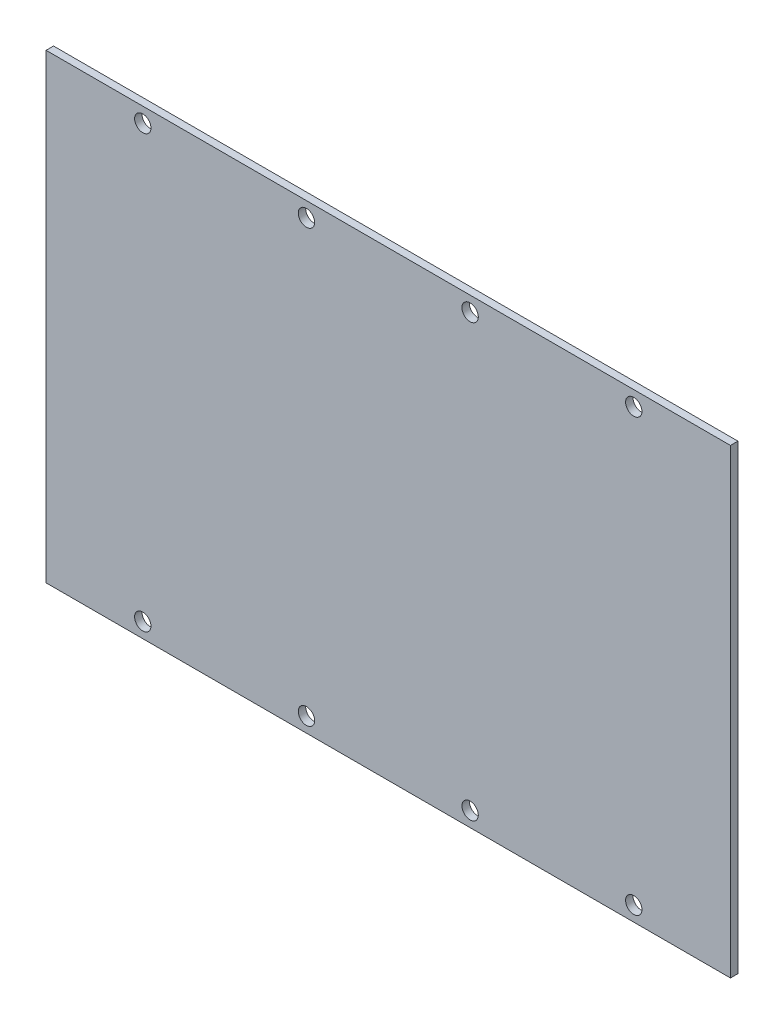
ISO-10303-21;
HEADER;
FILE_DESCRIPTION(('STEP AP214'),'2;1');
FILE_NAME('part.step','',(''),(''),'','','');
FILE_SCHEMA(('AUTOMOTIVE_DESIGN { 1 0 10303 214 1 1 1 1 }'));
ENDSEC;
DATA;
#1=APPLICATION_CONTEXT('core data for automotive mechanical design processes');
#2=APPLICATION_PROTOCOL_DEFINITION('international standard','automotive_design',2000,#1);
#3=PRODUCT_CONTEXT('',#1,'mechanical');
#4=PRODUCT('Part','Part','',(#3));
#5=PRODUCT_RELATED_PRODUCT_CATEGORY('part','',(#4));
#6=PRODUCT_DEFINITION_FORMATION('','',#4);
#7=PRODUCT_DEFINITION_CONTEXT('part definition',#1,'design');
#8=PRODUCT_DEFINITION('design','',#6,#7);
#9=PRODUCT_DEFINITION_SHAPE('','',#8);
#10=(LENGTH_UNIT() NAMED_UNIT(*) SI_UNIT(.MILLI.,.METRE.));
#11=(NAMED_UNIT(*) PLANE_ANGLE_UNIT() SI_UNIT($,.RADIAN.));
#12=(NAMED_UNIT(*) SI_UNIT($,.STERADIAN.) SOLID_ANGLE_UNIT());
#13=UNCERTAINTY_MEASURE_WITH_UNIT(LENGTH_MEASURE(1.E-05),#10,'distance_accuracy_value','');
#14=(GEOMETRIC_REPRESENTATION_CONTEXT(3) GLOBAL_UNCERTAINTY_ASSIGNED_CONTEXT((#13)) GLOBAL_UNIT_ASSIGNED_CONTEXT((#10,
#11,#12)) REPRESENTATION_CONTEXT('',''));
#15=CARTESIAN_POINT('',(0.,0.,0.));
#16=DIRECTION('',(0.,0.,1.));
#17=DIRECTION('',(1.,0.,0.));
#18=AXIS2_PLACEMENT_3D('',#15,#16,#17);
#19=CARTESIAN_POINT('',(0.,0.,-1.));
#20=DIRECTION('',(-1.,0.,0.));
#21=DIRECTION('',(0.,-1.,0.));
#22=AXIS2_PLACEMENT_3D('',#19,#20,#21);
#23=PLANE('',#22);
#24=DIRECTION('',(0.,-1.,0.));
#25=VECTOR('',#24,1.);
#26=CARTESIAN_POINT('',(0.,0.,0.));
#27=LINE('',#26,#25);
#28=CARTESIAN_POINT('',(0.,0.,0.));
#29=VERTEX_POINT('',#28);
#30=CARTESIAN_POINT('',(0.,-62.,0.));
#31=VERTEX_POINT('',#30);
#32=EDGE_CURVE('E99',#29,#31,#27,.T.);
#33=ORIENTED_EDGE('',*,*,#32,.F.);
#34=DIRECTION('',(0.,0.,1.));
#35=VECTOR('',#34,1.);
#36=CARTESIAN_POINT('',(0.,0.,-1.));
#37=LINE('',#36,#35);
#38=CARTESIAN_POINT('',(0.,0.,-1.));
#39=VERTEX_POINT('',#38);
#40=EDGE_CURVE('E11',#39,#29,#37,.T.);
#41=ORIENTED_EDGE('',*,*,#40,.F.);
#42=DIRECTION('',(0.,-1.,0.));
#43=VECTOR('',#42,1.);
#44=CARTESIAN_POINT('',(0.,0.,-1.));
#45=LINE('',#44,#43);
#46=CARTESIAN_POINT('',(0.,-62.,-1.));
#47=VERTEX_POINT('',#46);
#48=EDGE_CURVE('E92',#39,#47,#45,.T.);
#49=ORIENTED_EDGE('',*,*,#48,.T.);
#50=DIRECTION('',(0.,0.,1.));
#51=VECTOR('',#50,1.);
#52=CARTESIAN_POINT('',(0.,-62.,-1.));
#53=LINE('',#52,#51);
#54=EDGE_CURVE('E37',#47,#31,#53,.T.);
#55=ORIENTED_EDGE('',*,*,#54,.T.);
#56=EDGE_LOOP('',(#33,#41,#49,#55));
#57=FACE_BOUND('',#56,.T.);
#58=ADVANCED_FACE('F34',(#57),#23,.T.);
#59=CARTESIAN_POINT('',(0.,0.,-1.));
#60=DIRECTION('',(0.,1.,0.));
#61=DIRECTION('',(0.,0.,1.));
#62=AXIS2_PLACEMENT_3D('',#59,#60,#61);
#63=PLANE('',#62);
#64=DIRECTION('',(-1.,0.,0.));
#65=VECTOR('',#64,1.);
#66=CARTESIAN_POINT('',(0.,0.,0.));
#67=LINE('',#66,#65);
#68=CARTESIAN_POINT('',(92.,0.,0.));
#69=VERTEX_POINT('',#68);
#70=EDGE_CURVE('E94',#69,#29,#67,.T.);
#71=ORIENTED_EDGE('',*,*,#70,.F.);
#72=DIRECTION('',(0.,0.,1.));
#73=VECTOR('',#72,1.);
#74=CARTESIAN_POINT('',(92.,0.,-1.));
#75=LINE('',#74,#73);
#76=CARTESIAN_POINT('',(92.,0.,-1.));
#77=VERTEX_POINT('',#76);
#78=EDGE_CURVE('E43',#77,#69,#75,.T.);
#79=ORIENTED_EDGE('',*,*,#78,.F.);
#80=DIRECTION('',(-1.,0.,0.));
#81=VECTOR('',#80,1.);
#82=CARTESIAN_POINT('',(0.,0.,-1.));
#83=LINE('',#82,#81);
#84=EDGE_CURVE('E89',#77,#39,#83,.T.);
#85=ORIENTED_EDGE('',*,*,#84,.T.);
#86=ORIENTED_EDGE('',*,*,#40,.T.);
#87=EDGE_LOOP('',(#71,#79,#85,#86));
#88=FACE_BOUND('',#87,.T.);
#89=ADVANCED_FACE('F110',(#88),#63,.T.);
#90=CARTESIAN_POINT('',(92.,0.,-1.));
#91=DIRECTION('',(1.,0.,0.));
#92=DIRECTION('',(0.,1.,0.));
#93=AXIS2_PLACEMENT_3D('',#90,#91,#92);
#94=PLANE('',#93);
#95=DIRECTION('',(0.,1.,0.));
#96=VECTOR('',#95,1.);
#97=CARTESIAN_POINT('',(92.,0.,0.));
#98=LINE('',#97,#96);
#99=CARTESIAN_POINT('',(92.,-62.,0.));
#100=VERTEX_POINT('',#99);
#101=EDGE_CURVE('E84',#100,#69,#98,.T.);
#102=ORIENTED_EDGE('',*,*,#101,.F.);
#103=DIRECTION('',(0.,0.,1.));
#104=VECTOR('',#103,1.);
#105=CARTESIAN_POINT('',(92.,-62.,-1.));
#106=LINE('',#105,#104);
#107=CARTESIAN_POINT('',(92.,-62.,-1.));
#108=VERTEX_POINT('',#107);
#109=EDGE_CURVE('E79',#108,#100,#106,.T.);
#110=ORIENTED_EDGE('',*,*,#109,.F.);
#111=DIRECTION('',(0.,1.,0.));
#112=VECTOR('',#111,1.);
#113=CARTESIAN_POINT('',(92.,0.,-1.));
#114=LINE('',#113,#112);
#115=EDGE_CURVE('E82',#108,#77,#114,.T.);
#116=ORIENTED_EDGE('',*,*,#115,.T.);
#117=ORIENTED_EDGE('',*,*,#78,.T.);
#118=EDGE_LOOP('',(#102,#110,#116,#117));
#119=FACE_BOUND('',#118,.T.);
#120=ADVANCED_FACE('F81',(#119),#94,.T.);
#121=CARTESIAN_POINT('',(0.,-62.,-1.));
#122=DIRECTION('',(0.,-1.,0.));
#123=DIRECTION('',(0.,0.,-1.));
#124=AXIS2_PLACEMENT_3D('',#121,#122,#123);
#125=PLANE('',#124);
#126=DIRECTION('',(1.,0.,0.));
#127=VECTOR('',#126,1.);
#128=CARTESIAN_POINT('',(0.,-62.,0.));
#129=LINE('',#128,#127);
#130=EDGE_CURVE('E102',#31,#100,#129,.T.);
#131=ORIENTED_EDGE('',*,*,#130,.F.);
#132=ORIENTED_EDGE('',*,*,#54,.F.);
#133=DIRECTION('',(1.,0.,0.));
#134=VECTOR('',#133,1.);
#135=CARTESIAN_POINT('',(0.,-62.,-1.));
#136=LINE('',#135,#134);
#137=EDGE_CURVE('E88',#47,#108,#136,.T.);
#138=ORIENTED_EDGE('',*,*,#137,.T.);
#139=ORIENTED_EDGE('',*,*,#109,.T.);
#140=EDGE_LOOP('',(#131,#132,#138,#139));
#141=FACE_BOUND('',#140,.T.);
#142=ADVANCED_FACE('F91',(#141),#125,.T.);
#143=CARTESIAN_POINT('',(0.,0.,-1.));
#144=DIRECTION('',(0.,0.,1.));
#145=DIRECTION('',(1.,0.,0.));
#146=AXIS2_PLACEMENT_3D('',#143,#144,#145);
#147=PLANE('',#146);
#148=CARTESIAN_POINT('',(79.,-2.,-1.));
#149=DIRECTION('',(0.,0.,-1.));
#150=DIRECTION('',(-1.,0.,0.));
#151=AXIS2_PLACEMENT_3D('',#148,#149,#150);
#152=CIRCLE('',#151,1.09999999999999);
#153=CARTESIAN_POINT('',(77.9,-2.,-1.));
#154=VERTEX_POINT('',#153);
#155=EDGE_CURVE('E170',#154,#154,#152,.T.);
#156=ORIENTED_EDGE('',*,*,#155,.F.);
#157=EDGE_LOOP('',(#156));
#158=FACE_BOUND('',#157,.T.);
#159=CARTESIAN_POINT('',(57.,-2.,-1.));
#160=DIRECTION('',(0.,0.,-1.));
#161=DIRECTION('',(-1.,0.,0.));
#162=AXIS2_PLACEMENT_3D('',#159,#160,#161);
#163=CIRCLE('',#162,1.09999999999999);
#164=CARTESIAN_POINT('',(55.9,-2.,-1.));
#165=VERTEX_POINT('',#164);
#166=EDGE_CURVE('E172',#165,#165,#163,.T.);
#167=ORIENTED_EDGE('',*,*,#166,.F.);
#168=EDGE_LOOP('',(#167));
#169=FACE_BOUND('',#168,.T.);
#170=CARTESIAN_POINT('',(35.,-2.,-1.));
#171=DIRECTION('',(0.,0.,-1.));
#172=DIRECTION('',(-1.,0.,0.));
#173=AXIS2_PLACEMENT_3D('',#170,#171,#172);
#174=CIRCLE('',#173,1.09999999999999);
#175=CARTESIAN_POINT('',(33.9,-2.,-1.));
#176=VERTEX_POINT('',#175);
#177=EDGE_CURVE('E180',#176,#176,#174,.T.);
#178=ORIENTED_EDGE('',*,*,#177,.F.);
#179=EDGE_LOOP('',(#178));
#180=FACE_BOUND('',#179,.T.);
#181=CARTESIAN_POINT('',(13.,-2.,-1.));
#182=DIRECTION('',(0.,0.,-1.));
#183=DIRECTION('',(-1.,0.,0.));
#184=AXIS2_PLACEMENT_3D('',#181,#182,#183);
#185=CIRCLE('',#184,1.09999999999999);
#186=CARTESIAN_POINT('',(11.9,-2.,-1.));
#187=VERTEX_POINT('',#186);
#188=EDGE_CURVE('E186',#187,#187,#185,.T.);
#189=ORIENTED_EDGE('',*,*,#188,.F.);
#190=EDGE_LOOP('',(#189));
#191=FACE_BOUND('',#190,.T.);
#192=CARTESIAN_POINT('',(13.,-60.,-1.));
#193=DIRECTION('',(0.,0.,-1.));
#194=DIRECTION('',(-1.,0.,0.));
#195=AXIS2_PLACEMENT_3D('',#192,#193,#194);
#196=CIRCLE('',#195,1.09999999999999);
#197=CARTESIAN_POINT('',(11.9,-60.,-1.));
#198=VERTEX_POINT('',#197);
#199=EDGE_CURVE('E192',#198,#198,#196,.T.);
#200=ORIENTED_EDGE('',*,*,#199,.F.);
#201=EDGE_LOOP('',(#200));
#202=FACE_BOUND('',#201,.T.);
#203=CARTESIAN_POINT('',(35.,-60.,-1.));
#204=DIRECTION('',(0.,0.,-1.));
#205=DIRECTION('',(-1.,0.,0.));
#206=AXIS2_PLACEMENT_3D('',#203,#204,#205);
#207=CIRCLE('',#206,1.09999999999999);
#208=CARTESIAN_POINT('',(33.9,-60.,-1.));
#209=VERTEX_POINT('',#208);
#210=EDGE_CURVE('E198',#209,#209,#207,.T.);
#211=ORIENTED_EDGE('',*,*,#210,.F.);
#212=EDGE_LOOP('',(#211));
#213=FACE_BOUND('',#212,.T.);
#214=CARTESIAN_POINT('',(57.,-60.,-1.));
#215=DIRECTION('',(0.,0.,-1.));
#216=DIRECTION('',(-1.,0.,0.));
#217=AXIS2_PLACEMENT_3D('',#214,#215,#216);
#218=CIRCLE('',#217,1.09999999999999);
#219=CARTESIAN_POINT('',(55.9,-60.,-1.));
#220=VERTEX_POINT('',#219);
#221=EDGE_CURVE('E204',#220,#220,#218,.T.);
#222=ORIENTED_EDGE('',*,*,#221,.F.);
#223=EDGE_LOOP('',(#222));
#224=FACE_BOUND('',#223,.T.);
#225=CARTESIAN_POINT('',(79.,-60.,-1.));
#226=DIRECTION('',(0.,0.,-1.));
#227=DIRECTION('',(-1.,0.,0.));
#228=AXIS2_PLACEMENT_3D('',#225,#226,#227);
#229=CIRCLE('',#228,1.09999999999999);
#230=CARTESIAN_POINT('',(77.9,-60.,-1.));
#231=VERTEX_POINT('',#230);
#232=EDGE_CURVE('E210',#231,#231,#229,.T.);
#233=ORIENTED_EDGE('',*,*,#232,.F.);
#234=EDGE_LOOP('',(#233));
#235=FACE_BOUND('',#234,.T.);
#236=ORIENTED_EDGE('',*,*,#48,.F.);
#237=ORIENTED_EDGE('',*,*,#84,.F.);
#238=ORIENTED_EDGE('',*,*,#115,.F.);
#239=ORIENTED_EDGE('',*,*,#137,.F.);
#240=EDGE_LOOP('',(#236,#237,#238,#239));
#241=FACE_BOUND('',#240,.T.);
#242=ADVANCED_FACE('F87',(#158,#169,#180,#191,#202,#213,#224,#235,#241),#147,.F.);
#243=CARTESIAN_POINT('',(0.,0.,0.));
#244=DIRECTION('',(0.,0.,1.));
#245=DIRECTION('',(1.,0.,0.));
#246=AXIS2_PLACEMENT_3D('',#243,#244,#245);
#247=PLANE('',#246);
#248=CARTESIAN_POINT('',(79.,-2.,0.));
#249=DIRECTION('',(0.,0.,-1.));
#250=DIRECTION('',(-1.,0.,0.));
#251=AXIS2_PLACEMENT_3D('',#248,#249,#250);
#252=CIRCLE('',#251,1.09999999999999);
#253=CARTESIAN_POINT('',(77.9,-2.,0.));
#254=VERTEX_POINT('',#253);
#255=EDGE_CURVE('E168',#254,#254,#252,.T.);
#256=ORIENTED_EDGE('',*,*,#255,.T.);
#257=EDGE_LOOP('',(#256));
#258=FACE_BOUND('',#257,.T.);
#259=CARTESIAN_POINT('',(57.,-2.,0.));
#260=DIRECTION('',(0.,0.,-1.));
#261=DIRECTION('',(-1.,0.,0.));
#262=AXIS2_PLACEMENT_3D('',#259,#260,#261);
#263=CIRCLE('',#262,1.09999999999999);
#264=CARTESIAN_POINT('',(55.9,-2.,0.));
#265=VERTEX_POINT('',#264);
#266=EDGE_CURVE('E177',#265,#265,#263,.T.);
#267=ORIENTED_EDGE('',*,*,#266,.T.);
#268=EDGE_LOOP('',(#267));
#269=FACE_BOUND('',#268,.T.);
#270=CARTESIAN_POINT('',(35.,-2.,0.));
#271=DIRECTION('',(0.,0.,-1.));
#272=DIRECTION('',(-1.,0.,0.));
#273=AXIS2_PLACEMENT_3D('',#270,#271,#272);
#274=CIRCLE('',#273,1.09999999999999);
#275=CARTESIAN_POINT('',(33.9,-2.,0.));
#276=VERTEX_POINT('',#275);
#277=EDGE_CURVE('E183',#276,#276,#274,.T.);
#278=ORIENTED_EDGE('',*,*,#277,.T.);
#279=EDGE_LOOP('',(#278));
#280=FACE_BOUND('',#279,.T.);
#281=CARTESIAN_POINT('',(13.,-2.,0.));
#282=DIRECTION('',(0.,0.,-1.));
#283=DIRECTION('',(-1.,0.,0.));
#284=AXIS2_PLACEMENT_3D('',#281,#282,#283);
#285=CIRCLE('',#284,1.09999999999999);
#286=CARTESIAN_POINT('',(11.9,-2.,0.));
#287=VERTEX_POINT('',#286);
#288=EDGE_CURVE('E189',#287,#287,#285,.T.);
#289=ORIENTED_EDGE('',*,*,#288,.T.);
#290=EDGE_LOOP('',(#289));
#291=FACE_BOUND('',#290,.T.);
#292=CARTESIAN_POINT('',(13.,-60.,0.));
#293=DIRECTION('',(0.,0.,-1.));
#294=DIRECTION('',(-1.,0.,0.));
#295=AXIS2_PLACEMENT_3D('',#292,#293,#294);
#296=CIRCLE('',#295,1.09999999999999);
#297=CARTESIAN_POINT('',(11.9,-60.,0.));
#298=VERTEX_POINT('',#297);
#299=EDGE_CURVE('E195',#298,#298,#296,.T.);
#300=ORIENTED_EDGE('',*,*,#299,.T.);
#301=EDGE_LOOP('',(#300));
#302=FACE_BOUND('',#301,.T.);
#303=CARTESIAN_POINT('',(35.,-60.,0.));
#304=DIRECTION('',(0.,0.,-1.));
#305=DIRECTION('',(-1.,0.,0.));
#306=AXIS2_PLACEMENT_3D('',#303,#304,#305);
#307=CIRCLE('',#306,1.09999999999999);
#308=CARTESIAN_POINT('',(33.9,-60.,0.));
#309=VERTEX_POINT('',#308);
#310=EDGE_CURVE('E201',#309,#309,#307,.T.);
#311=ORIENTED_EDGE('',*,*,#310,.T.);
#312=EDGE_LOOP('',(#311));
#313=FACE_BOUND('',#312,.T.);
#314=CARTESIAN_POINT('',(57.,-60.,0.));
#315=DIRECTION('',(0.,0.,-1.));
#316=DIRECTION('',(-1.,0.,0.));
#317=AXIS2_PLACEMENT_3D('',#314,#315,#316);
#318=CIRCLE('',#317,1.09999999999999);
#319=CARTESIAN_POINT('',(55.9,-60.,0.));
#320=VERTEX_POINT('',#319);
#321=EDGE_CURVE('E207',#320,#320,#318,.T.);
#322=ORIENTED_EDGE('',*,*,#321,.T.);
#323=EDGE_LOOP('',(#322));
#324=FACE_BOUND('',#323,.T.);
#325=CARTESIAN_POINT('',(79.,-60.,0.));
#326=DIRECTION('',(0.,0.,-1.));
#327=DIRECTION('',(-1.,0.,0.));
#328=AXIS2_PLACEMENT_3D('',#325,#326,#327);
#329=CIRCLE('',#328,1.09999999999999);
#330=CARTESIAN_POINT('',(77.9,-60.,0.));
#331=VERTEX_POINT('',#330);
#332=EDGE_CURVE('E103',#331,#331,#329,.T.);
#333=ORIENTED_EDGE('',*,*,#332,.T.);
#334=EDGE_LOOP('',(#333));
#335=FACE_BOUND('',#334,.T.);
#336=ORIENTED_EDGE('',*,*,#32,.T.);
#337=ORIENTED_EDGE('',*,*,#130,.T.);
#338=ORIENTED_EDGE('',*,*,#101,.T.);
#339=ORIENTED_EDGE('',*,*,#70,.T.);
#340=EDGE_LOOP('',(#336,#337,#338,#339));
#341=FACE_BOUND('',#340,.T.);
#342=ADVANCED_FACE('F109',(#258,#269,#280,#291,#302,#313,#324,#335,#341),#247,.T.);
#343=CARTESIAN_POINT('',(79.,-60.,-1.));
#344=DIRECTION('',(0.,0.,-1.));
#345=DIRECTION('',(-1.,0.,0.));
#346=AXIS2_PLACEMENT_3D('',#343,#344,#345);
#347=CYLINDRICAL_SURFACE('',#346,1.09999999999999);
#348=ORIENTED_EDGE('',*,*,#332,.F.);
#349=EDGE_LOOP('',(#348));
#350=FACE_BOUND('',#349,.T.);
#351=ORIENTED_EDGE('',*,*,#232,.T.);
#352=EDGE_LOOP('',(#351));
#353=FACE_BOUND('',#352,.T.);
#354=ADVANCED_FACE('F128',(#350,#353),#347,.F.);
#355=CARTESIAN_POINT('',(57.,-60.,-1.));
#356=DIRECTION('',(0.,0.,-1.));
#357=DIRECTION('',(-1.,0.,0.));
#358=AXIS2_PLACEMENT_3D('',#355,#356,#357);
#359=CYLINDRICAL_SURFACE('',#358,1.09999999999999);
#360=ORIENTED_EDGE('',*,*,#321,.F.);
#361=EDGE_LOOP('',(#360));
#362=FACE_BOUND('',#361,.T.);
#363=ORIENTED_EDGE('',*,*,#221,.T.);
#364=EDGE_LOOP('',(#363));
#365=FACE_BOUND('',#364,.T.);
#366=ADVANCED_FACE('F135',(#362,#365),#359,.F.);
#367=CARTESIAN_POINT('',(35.,-60.,-1.));
#368=DIRECTION('',(0.,0.,-1.));
#369=DIRECTION('',(-1.,0.,0.));
#370=AXIS2_PLACEMENT_3D('',#367,#368,#369);
#371=CYLINDRICAL_SURFACE('',#370,1.09999999999999);
#372=ORIENTED_EDGE('',*,*,#310,.F.);
#373=EDGE_LOOP('',(#372));
#374=FACE_BOUND('',#373,.T.);
#375=ORIENTED_EDGE('',*,*,#210,.T.);
#376=EDGE_LOOP('',(#375));
#377=FACE_BOUND('',#376,.T.);
#378=ADVANCED_FACE('F139',(#374,#377),#371,.F.);
#379=CARTESIAN_POINT('',(13.,-60.,-1.));
#380=DIRECTION('',(0.,0.,-1.));
#381=DIRECTION('',(-1.,0.,0.));
#382=AXIS2_PLACEMENT_3D('',#379,#380,#381);
#383=CYLINDRICAL_SURFACE('',#382,1.09999999999999);
#384=ORIENTED_EDGE('',*,*,#299,.F.);
#385=EDGE_LOOP('',(#384));
#386=FACE_BOUND('',#385,.T.);
#387=ORIENTED_EDGE('',*,*,#199,.T.);
#388=EDGE_LOOP('',(#387));
#389=FACE_BOUND('',#388,.T.);
#390=ADVANCED_FACE('F143',(#386,#389),#383,.F.);
#391=CARTESIAN_POINT('',(13.,-2.,-1.));
#392=DIRECTION('',(0.,0.,-1.));
#393=DIRECTION('',(-1.,0.,0.));
#394=AXIS2_PLACEMENT_3D('',#391,#392,#393);
#395=CYLINDRICAL_SURFACE('',#394,1.09999999999999);
#396=ORIENTED_EDGE('',*,*,#288,.F.);
#397=EDGE_LOOP('',(#396));
#398=FACE_BOUND('',#397,.T.);
#399=ORIENTED_EDGE('',*,*,#188,.T.);
#400=EDGE_LOOP('',(#399));
#401=FACE_BOUND('',#400,.T.);
#402=ADVANCED_FACE('F147',(#398,#401),#395,.F.);
#403=CARTESIAN_POINT('',(35.,-2.,-1.));
#404=DIRECTION('',(0.,0.,-1.));
#405=DIRECTION('',(-1.,0.,0.));
#406=AXIS2_PLACEMENT_3D('',#403,#404,#405);
#407=CYLINDRICAL_SURFACE('',#406,1.09999999999999);
#408=ORIENTED_EDGE('',*,*,#277,.F.);
#409=EDGE_LOOP('',(#408));
#410=FACE_BOUND('',#409,.T.);
#411=ORIENTED_EDGE('',*,*,#177,.T.);
#412=EDGE_LOOP('',(#411));
#413=FACE_BOUND('',#412,.T.);
#414=ADVANCED_FACE('F151',(#410,#413),#407,.F.);
#415=CARTESIAN_POINT('',(57.,-2.,-1.));
#416=DIRECTION('',(0.,0.,-1.));
#417=DIRECTION('',(-1.,0.,0.));
#418=AXIS2_PLACEMENT_3D('',#415,#416,#417);
#419=CYLINDRICAL_SURFACE('',#418,1.09999999999999);
#420=ORIENTED_EDGE('',*,*,#266,.F.);
#421=EDGE_LOOP('',(#420));
#422=FACE_BOUND('',#421,.T.);
#423=ORIENTED_EDGE('',*,*,#166,.T.);
#424=EDGE_LOOP('',(#423));
#425=FACE_BOUND('',#424,.T.);
#426=ADVANCED_FACE('F155',(#422,#425),#419,.F.);
#427=CARTESIAN_POINT('',(79.,-2.,-1.));
#428=DIRECTION('',(0.,0.,-1.));
#429=DIRECTION('',(-1.,0.,0.));
#430=AXIS2_PLACEMENT_3D('',#427,#428,#429);
#431=CYLINDRICAL_SURFACE('',#430,1.09999999999999);
#432=ORIENTED_EDGE('',*,*,#255,.F.);
#433=EDGE_LOOP('',(#432));
#434=FACE_BOUND('',#433,.T.);
#435=ORIENTED_EDGE('',*,*,#155,.T.);
#436=EDGE_LOOP('',(#435));
#437=FACE_BOUND('',#436,.T.);
#438=ADVANCED_FACE('F159',(#434,#437),#431,.F.);
#439=CLOSED_SHELL('',(#58,#89,#120,#142,#242,#342,#354,#366,#378,#390,#402,#414,#426,#438));
#440=MANIFOLD_SOLID_BREP('B2',#439);
#441=ADVANCED_BREP_SHAPE_REPRESENTATION('',(#18,#440),#14);
#442=SHAPE_DEFINITION_REPRESENTATION(#9,#441);
ENDSEC;
END-ISO-10303-21;
